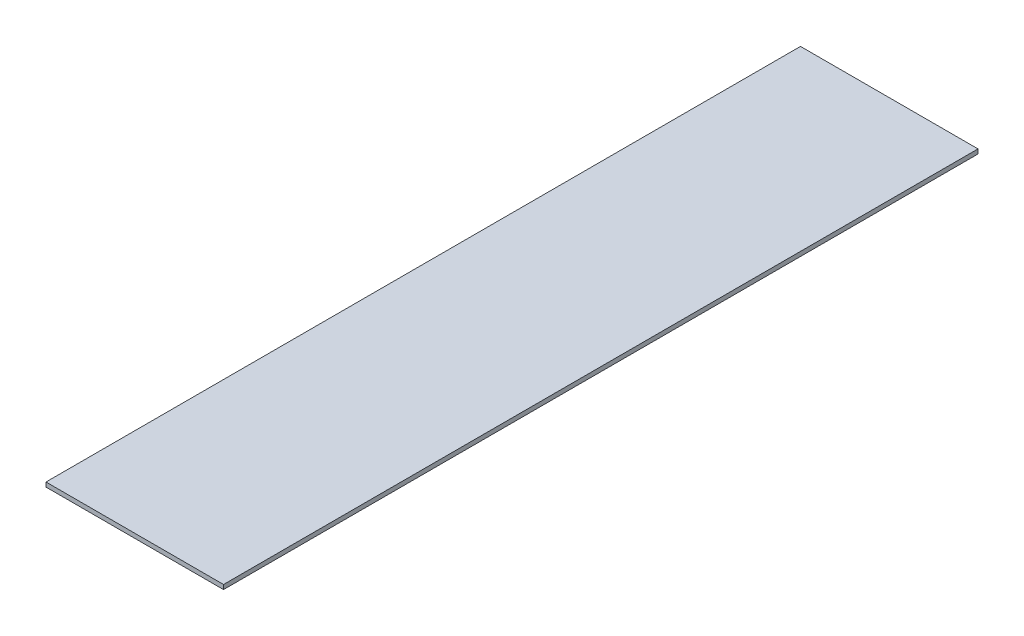
ISO-10303-21;
HEADER;
FILE_DESCRIPTION(('STEP AP214'),'2;1');
FILE_NAME('part.step','',(''),(''),'','','');
FILE_SCHEMA(('AUTOMOTIVE_DESIGN { 1 0 10303 214 1 1 1 1 }'));
ENDSEC;
DATA;
#1=APPLICATION_CONTEXT('core data for automotive mechanical design processes');
#2=APPLICATION_PROTOCOL_DEFINITION('international standard','automotive_design',2000,#1);
#3=PRODUCT_CONTEXT('',#1,'mechanical');
#4=PRODUCT('Part','Part','',(#3));
#5=PRODUCT_RELATED_PRODUCT_CATEGORY('part','',(#4));
#6=PRODUCT_DEFINITION_FORMATION('','',#4);
#7=PRODUCT_DEFINITION_CONTEXT('part definition',#1,'design');
#8=PRODUCT_DEFINITION('design','',#6,#7);
#9=PRODUCT_DEFINITION_SHAPE('','',#8);
#10=(LENGTH_UNIT() NAMED_UNIT(*) SI_UNIT(.MILLI.,.METRE.));
#11=(NAMED_UNIT(*) PLANE_ANGLE_UNIT() SI_UNIT($,.RADIAN.));
#12=(NAMED_UNIT(*) SI_UNIT($,.STERADIAN.) SOLID_ANGLE_UNIT());
#13=UNCERTAINTY_MEASURE_WITH_UNIT(LENGTH_MEASURE(1.E-05),#10,'distance_accuracy_value','');
#14=(GEOMETRIC_REPRESENTATION_CONTEXT(3) GLOBAL_UNCERTAINTY_ASSIGNED_CONTEXT((#13)) GLOBAL_UNIT_ASSIGNED_CONTEXT((#10,
#11,#12)) REPRESENTATION_CONTEXT('',''));
#15=CARTESIAN_POINT('',(0.,0.,0.));
#16=DIRECTION('',(0.,0.,1.));
#17=DIRECTION('',(1.,0.,0.));
#18=AXIS2_PLACEMENT_3D('',#15,#16,#17);
#19=CARTESIAN_POINT('',(0.,10.,0.));
#20=DIRECTION('',(1.,0.,0.));
#21=DIRECTION('',(0.,0.,-1.));
#22=AXIS2_PLACEMENT_3D('',#19,#20,#21);
#23=PLANE('',#22);
#24=DIRECTION('',(0.,0.,1.));
#25=VECTOR('',#24,1.);
#26=CARTESIAN_POINT('',(0.,0.,0.));
#27=LINE('',#26,#25);
#28=CARTESIAN_POINT('',(0.,0.,-1700.));
#29=VERTEX_POINT('',#28);
#30=CARTESIAN_POINT('',(0.,0.,0.));
#31=VERTEX_POINT('',#30);
#32=EDGE_CURVE('E94',#29,#31,#27,.T.);
#33=ORIENTED_EDGE('',*,*,#32,.T.);
#34=DIRECTION('',(0.,-1.,0.));
#35=VECTOR('',#34,1.);
#36=CARTESIAN_POINT('',(0.,10.,0.));
#37=LINE('',#36,#35);
#38=CARTESIAN_POINT('',(0.,10.,0.));
#39=VERTEX_POINT('',#38);
#40=EDGE_CURVE('E11',#39,#31,#37,.T.);
#41=ORIENTED_EDGE('',*,*,#40,.F.);
#42=DIRECTION('',(0.,0.,1.));
#43=VECTOR('',#42,1.);
#44=CARTESIAN_POINT('',(0.,10.,0.));
#45=LINE('',#44,#43);
#46=CARTESIAN_POINT('',(0.,10.,-1700.));
#47=VERTEX_POINT('',#46);
#48=EDGE_CURVE('E82',#47,#39,#45,.T.);
#49=ORIENTED_EDGE('',*,*,#48,.F.);
#50=DIRECTION('',(0.,-1.,0.));
#51=VECTOR('',#50,1.);
#52=CARTESIAN_POINT('',(0.,10.,-1700.));
#53=LINE('',#52,#51);
#54=EDGE_CURVE('E90',#47,#29,#53,.T.);
#55=ORIENTED_EDGE('',*,*,#54,.T.);
#56=EDGE_LOOP('',(#33,#41,#49,#55));
#57=FACE_BOUND('',#56,.T.);
#58=ADVANCED_FACE('F31',(#57),#23,.F.);
#59=CARTESIAN_POINT('',(0.,10.,0.));
#60=DIRECTION('',(0.,0.,-1.));
#61=DIRECTION('',(-1.,0.,0.));
#62=AXIS2_PLACEMENT_3D('',#59,#60,#61);
#63=PLANE('',#62);
#64=DIRECTION('',(1.,0.,0.));
#65=VECTOR('',#64,1.);
#66=CARTESIAN_POINT('',(0.,0.,0.));
#67=LINE('',#66,#65);
#68=CARTESIAN_POINT('',(400.,0.,0.));
#69=VERTEX_POINT('',#68);
#70=EDGE_CURVE('E86',#31,#69,#67,.T.);
#71=ORIENTED_EDGE('',*,*,#70,.T.);
#72=DIRECTION('',(0.,-1.,0.));
#73=VECTOR('',#72,1.);
#74=CARTESIAN_POINT('',(400.,10.,0.));
#75=LINE('',#74,#73);
#76=CARTESIAN_POINT('',(400.,10.,0.));
#77=VERTEX_POINT('',#76);
#78=EDGE_CURVE('E39',#77,#69,#75,.T.);
#79=ORIENTED_EDGE('',*,*,#78,.F.);
#80=DIRECTION('',(1.,0.,0.));
#81=VECTOR('',#80,1.);
#82=CARTESIAN_POINT('',(0.,10.,0.));
#83=LINE('',#82,#81);
#84=EDGE_CURVE('E77',#39,#77,#83,.T.);
#85=ORIENTED_EDGE('',*,*,#84,.F.);
#86=ORIENTED_EDGE('',*,*,#40,.T.);
#87=EDGE_LOOP('',(#71,#79,#85,#86));
#88=FACE_BOUND('',#87,.T.);
#89=ADVANCED_FACE('F85',(#88),#63,.F.);
#90=CARTESIAN_POINT('',(400.,10.,0.));
#91=DIRECTION('',(-1.,0.,0.));
#92=DIRECTION('',(0.,0.,1.));
#93=AXIS2_PLACEMENT_3D('',#90,#91,#92);
#94=PLANE('',#93);
#95=DIRECTION('',(0.,0.,-1.));
#96=VECTOR('',#95,1.);
#97=CARTESIAN_POINT('',(400.,0.,0.));
#98=LINE('',#97,#96);
#99=CARTESIAN_POINT('',(400.,0.,-1700.));
#100=VERTEX_POINT('',#99);
#101=EDGE_CURVE('E64',#69,#100,#98,.T.);
#102=ORIENTED_EDGE('',*,*,#101,.T.);
#103=DIRECTION('',(0.,-1.,0.));
#104=VECTOR('',#103,1.);
#105=CARTESIAN_POINT('',(400.,10.,-1700.));
#106=LINE('',#105,#104);
#107=CARTESIAN_POINT('',(400.,10.,-1700.));
#108=VERTEX_POINT('',#107);
#109=EDGE_CURVE('E87',#108,#100,#106,.T.);
#110=ORIENTED_EDGE('',*,*,#109,.F.);
#111=DIRECTION('',(0.,0.,-1.));
#112=VECTOR('',#111,1.);
#113=CARTESIAN_POINT('',(400.,10.,0.));
#114=LINE('',#113,#112);
#115=EDGE_CURVE('E80',#77,#108,#114,.T.);
#116=ORIENTED_EDGE('',*,*,#115,.F.);
#117=ORIENTED_EDGE('',*,*,#78,.T.);
#118=EDGE_LOOP('',(#102,#110,#116,#117));
#119=FACE_BOUND('',#118,.T.);
#120=ADVANCED_FACE('F88',(#119),#94,.F.);
#121=CARTESIAN_POINT('',(0.,10.,-1700.));
#122=DIRECTION('',(0.,0.,1.));
#123=DIRECTION('',(1.,0.,0.));
#124=AXIS2_PLACEMENT_3D('',#121,#122,#123);
#125=PLANE('',#124);
#126=DIRECTION('',(-1.,0.,0.));
#127=VECTOR('',#126,1.);
#128=CARTESIAN_POINT('',(0.,0.,-1700.));
#129=LINE('',#128,#127);
#130=EDGE_CURVE('E70',#100,#29,#129,.T.);
#131=ORIENTED_EDGE('',*,*,#130,.T.);
#132=ORIENTED_EDGE('',*,*,#54,.F.);
#133=DIRECTION('',(-1.,0.,0.));
#134=VECTOR('',#133,1.);
#135=CARTESIAN_POINT('',(0.,10.,-1700.));
#136=LINE('',#135,#134);
#137=EDGE_CURVE('E47',#108,#47,#136,.T.);
#138=ORIENTED_EDGE('',*,*,#137,.F.);
#139=ORIENTED_EDGE('',*,*,#109,.T.);
#140=EDGE_LOOP('',(#131,#132,#138,#139));
#141=FACE_BOUND('',#140,.T.);
#142=ADVANCED_FACE('F101',(#141),#125,.F.);
#143=CARTESIAN_POINT('',(0.,10.,-1700.));
#144=DIRECTION('',(0.,-1.,0.));
#145=DIRECTION('',(0.,0.,-1.));
#146=AXIS2_PLACEMENT_3D('',#143,#144,#145);
#147=PLANE('',#146);
#148=ORIENTED_EDGE('',*,*,#48,.T.);
#149=ORIENTED_EDGE('',*,*,#84,.T.);
#150=ORIENTED_EDGE('',*,*,#115,.T.);
#151=ORIENTED_EDGE('',*,*,#137,.T.);
#152=EDGE_LOOP('',(#148,#149,#150,#151));
#153=FACE_BOUND('',#152,.T.);
#154=ADVANCED_FACE('F78',(#153),#147,.F.);
#155=CARTESIAN_POINT('',(0.,0.,-1700.));
#156=DIRECTION('',(0.,-1.,0.));
#157=DIRECTION('',(0.,0.,-1.));
#158=AXIS2_PLACEMENT_3D('',#155,#156,#157);
#159=PLANE('',#158);
#160=ORIENTED_EDGE('',*,*,#32,.F.);
#161=ORIENTED_EDGE('',*,*,#130,.F.);
#162=ORIENTED_EDGE('',*,*,#101,.F.);
#163=ORIENTED_EDGE('',*,*,#70,.F.);
#164=EDGE_LOOP('',(#160,#161,#162,#163));
#165=FACE_BOUND('',#164,.T.);
#166=ADVANCED_FACE('F104',(#165),#159,.T.);
#167=CLOSED_SHELL('',(#58,#89,#120,#142,#154,#166));
#168=MANIFOLD_SOLID_BREP('B2',#167);
#169=ADVANCED_BREP_SHAPE_REPRESENTATION('',(#18,#168),#14);
#170=SHAPE_DEFINITION_REPRESENTATION(#9,#169);
ENDSEC;
END-ISO-10303-21;
